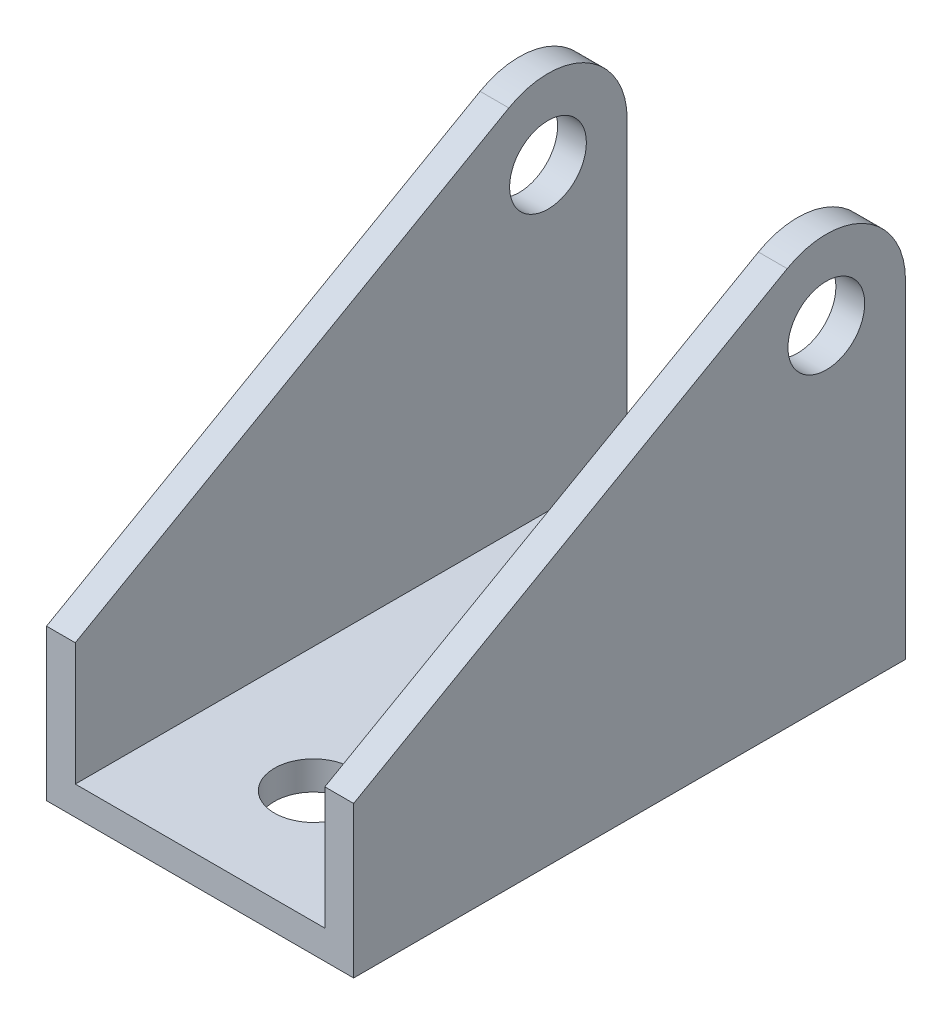
ISO-10303-21;
HEADER;
FILE_DESCRIPTION(('STEP AP214'),'2;1');
FILE_NAME('part.step','',(''),(''),'','','');
FILE_SCHEMA(('AUTOMOTIVE_DESIGN { 1 0 10303 214 1 1 1 1 }'));
ENDSEC;
DATA;
#1=APPLICATION_CONTEXT('core data for automotive mechanical design processes');
#2=APPLICATION_PROTOCOL_DEFINITION('international standard','automotive_design',2000,#1);
#3=PRODUCT_CONTEXT('',#1,'mechanical');
#4=PRODUCT('Part','Part','',(#3));
#5=PRODUCT_RELATED_PRODUCT_CATEGORY('part','',(#4));
#6=PRODUCT_DEFINITION_FORMATION('','',#4);
#7=PRODUCT_DEFINITION_CONTEXT('part definition',#1,'design');
#8=PRODUCT_DEFINITION('design','',#6,#7);
#9=PRODUCT_DEFINITION_SHAPE('','',#8);
#10=(LENGTH_UNIT() NAMED_UNIT(*) SI_UNIT(.MILLI.,.METRE.));
#11=(NAMED_UNIT(*) PLANE_ANGLE_UNIT() SI_UNIT($,.RADIAN.));
#12=(NAMED_UNIT(*) SI_UNIT($,.STERADIAN.) SOLID_ANGLE_UNIT());
#13=UNCERTAINTY_MEASURE_WITH_UNIT(LENGTH_MEASURE(1.E-05),#10,'distance_accuracy_value','');
#14=(GEOMETRIC_REPRESENTATION_CONTEXT(3) GLOBAL_UNCERTAINTY_ASSIGNED_CONTEXT((#13)) GLOBAL_UNIT_ASSIGNED_CONTEXT((#10,
#11,#12)) REPRESENTATION_CONTEXT('',''));
#15=CARTESIAN_POINT('',(0.,0.,0.));
#16=DIRECTION('',(0.,0.,1.));
#17=DIRECTION('',(1.,0.,0.));
#18=AXIS2_PLACEMENT_3D('',#15,#16,#17);
#19=CARTESIAN_POINT('',(-32.512,0.,-58.42));
#20=DIRECTION('',(0.,0.,-1.));
#21=DIRECTION('',(-1.,0.,0.));
#22=AXIS2_PLACEMENT_3D('',#19,#20,#21);
#23=PLANE('',#22);
#24=DIRECTION('',(1.,0.,0.));
#25=VECTOR('',#24,1.);
#26=CARTESIAN_POINT('',(-32.512,0.,-58.42));
#27=LINE('',#26,#25);
#28=CARTESIAN_POINT('',(-11.938,0.,-58.42));
#29=VERTEX_POINT('',#28);
#30=CARTESIAN_POINT('',(0.,0.,-58.42));
#31=VERTEX_POINT('',#30);
#32=EDGE_CURVE('E164',#29,#31,#27,.T.);
#33=ORIENTED_EDGE('',*,*,#32,.F.);
#34=DIRECTION('',(0.,-1.,0.));
#35=VECTOR('',#34,1.);
#36=CARTESIAN_POINT('',(-11.938,43.18,-58.42));
#37=LINE('',#36,#35);
#38=CARTESIAN_POINT('',(-11.938,3.048,-58.42));
#39=VERTEX_POINT('',#38);
#40=EDGE_CURVE('E156',#39,#29,#37,.T.);
#41=ORIENTED_EDGE('',*,*,#40,.F.);
#42=DIRECTION('',(1.,0.,0.));
#43=VECTOR('',#42,1.);
#44=CARTESIAN_POINT('',(-29.464,3.048,-58.42));
#45=LINE('',#44,#43);
#46=CARTESIAN_POINT('',(-3.048,3.048,-58.42));
#47=VERTEX_POINT('',#46);
#48=EDGE_CURVE('E59',#39,#47,#45,.T.);
#49=ORIENTED_EDGE('',*,*,#48,.T.);
#50=DIRECTION('',(0.,1.,0.));
#51=VECTOR('',#50,1.);
#52=CARTESIAN_POINT('',(-3.048,3.048,-58.42));
#53=LINE('',#52,#51);
#54=CARTESIAN_POINT('',(-3.048,34.798,-58.42));
#55=VERTEX_POINT('',#54);
#56=EDGE_CURVE('E203',#47,#55,#53,.T.);
#57=ORIENTED_EDGE('',*,*,#56,.T.);
#58=DIRECTION('',(1.,0.,0.));
#59=VECTOR('',#58,1.);
#60=CARTESIAN_POINT('',(-32.512,34.798,-58.42));
#61=LINE('',#60,#59);
#62=CARTESIAN_POINT('',(0.,34.798,-58.42));
#63=VERTEX_POINT('',#62);
#64=EDGE_CURVE('E163',#55,#63,#61,.T.);
#65=ORIENTED_EDGE('',*,*,#64,.T.);
#66=DIRECTION('',(0.,1.,0.));
#67=VECTOR('',#66,1.);
#68=CARTESIAN_POINT('',(0.,0.,-58.42));
#69=LINE('',#68,#67);
#70=EDGE_CURVE('E248',#31,#63,#69,.T.);
#71=ORIENTED_EDGE('',*,*,#70,.F.);
#72=EDGE_LOOP('',(#33,#41,#49,#57,#65,#71));
#73=FACE_BOUND('',#72,.T.);
#74=ADVANCED_FACE('F35',(#73),#23,.T.);
#75=CARTESIAN_POINT('',(-29.464,3.048,-58.42));
#76=VERTEX_POINT('',#75);
#77=CARTESIAN_POINT('',(-20.574,3.048,-58.42));
#78=VERTEX_POINT('',#77);
#79=EDGE_CURVE('E155',#76,#78,#45,.T.);
#80=ORIENTED_EDGE('',*,*,#79,.T.);
#81=DIRECTION('',(0.,-1.,0.));
#82=VECTOR('',#81,1.);
#83=CARTESIAN_POINT('',(-20.574,43.18,-58.42));
#84=LINE('',#83,#82);
#85=CARTESIAN_POINT('',(-20.574,0.,-58.42));
#86=VERTEX_POINT('',#85);
#87=EDGE_CURVE('E51',#78,#86,#84,.T.);
#88=ORIENTED_EDGE('',*,*,#87,.T.);
#89=CARTESIAN_POINT('',(-32.512,0.,-58.42));
#90=VERTEX_POINT('',#89);
#91=EDGE_CURVE('E151',#90,#86,#27,.T.);
#92=ORIENTED_EDGE('',*,*,#91,.F.);
#93=DIRECTION('',(0.,1.,0.));
#94=VECTOR('',#93,1.);
#95=CARTESIAN_POINT('',(-32.512,0.,-58.42));
#96=LINE('',#95,#94);
#97=CARTESIAN_POINT('',(-32.512,34.798,-58.42));
#98=VERTEX_POINT('',#97);
#99=EDGE_CURVE('E236',#90,#98,#96,.T.);
#100=ORIENTED_EDGE('',*,*,#99,.T.);
#101=CARTESIAN_POINT('',(-29.464,34.798,-58.42));
#102=VERTEX_POINT('',#101);
#103=EDGE_CURVE('E166',#98,#102,#61,.T.);
#104=ORIENTED_EDGE('',*,*,#103,.T.);
#105=DIRECTION('',(0.,-1.,0.));
#106=VECTOR('',#105,1.);
#107=CARTESIAN_POINT('',(-29.464,3.048,-58.42));
#108=LINE('',#107,#106);
#109=EDGE_CURVE('E201',#102,#76,#108,.T.);
#110=ORIENTED_EDGE('',*,*,#109,.T.);
#111=EDGE_LOOP('',(#80,#88,#92,#100,#104,#110));
#112=FACE_BOUND('',#111,.T.);
#113=ADVANCED_FACE('F149',(#112),#23,.T.);
#114=CARTESIAN_POINT('',(-32.512,0.,0.));
#115=DIRECTION('',(0.,-1.,0.));
#116=DIRECTION('',(0.,0.,-1.));
#117=AXIS2_PLACEMENT_3D('',#114,#115,#116);
#118=PLANE('',#117);
#119=CARTESIAN_POINT('',(-16.256,0.,-48.42));
#120=DIRECTION('',(0.,-1.,0.));
#121=DIRECTION('',(0.,0.,-1.));
#122=AXIS2_PLACEMENT_3D('',#119,#120,#121);
#123=CIRCLE('',#122,4.318);
#124=CARTESIAN_POINT('',(-20.574,0.,-48.42));
#125=VERTEX_POINT('',#124);
#126=CARTESIAN_POINT('',(-11.938,0.,-48.42));
#127=VERTEX_POINT('',#126);
#128=EDGE_CURVE('E300',#125,#127,#123,.F.);
#129=ORIENTED_EDGE('',*,*,#128,.T.);
#130=DIRECTION('',(0.,0.,-1.));
#131=VECTOR('',#130,1.);
#132=CARTESIAN_POINT('',(-11.938,0.,0.));
#133=LINE('',#132,#131);
#134=EDGE_CURVE('E144',#127,#29,#133,.T.);
#135=ORIENTED_EDGE('',*,*,#134,.T.);
#136=ORIENTED_EDGE('',*,*,#32,.T.);
#137=DIRECTION('',(0.,0.,-1.));
#138=VECTOR('',#137,1.);
#139=CARTESIAN_POINT('',(0.,0.,0.));
#140=LINE('',#139,#138);
#141=CARTESIAN_POINT('',(0.,0.,0.));
#142=VERTEX_POINT('',#141);
#143=EDGE_CURVE('E245',#142,#31,#140,.T.);
#144=ORIENTED_EDGE('',*,*,#143,.F.);
#145=DIRECTION('',(1.,0.,0.));
#146=VECTOR('',#145,1.);
#147=CARTESIAN_POINT('',(-32.512,0.,0.));
#148=LINE('',#147,#146);
#149=CARTESIAN_POINT('',(-32.512,0.,0.));
#150=VERTEX_POINT('',#149);
#151=EDGE_CURVE('E168',#150,#142,#148,.T.);
#152=ORIENTED_EDGE('',*,*,#151,.F.);
#153=DIRECTION('',(0.,0.,-1.));
#154=VECTOR('',#153,1.);
#155=CARTESIAN_POINT('',(-32.512,0.,0.));
#156=LINE('',#155,#154);
#157=EDGE_CURVE('E162',#150,#90,#156,.T.);
#158=ORIENTED_EDGE('',*,*,#157,.T.);
#159=ORIENTED_EDGE('',*,*,#91,.T.);
#160=DIRECTION('',(0.,0.,1.));
#161=VECTOR('',#160,1.);
#162=CARTESIAN_POINT('',(-20.574,0.,0.));
#163=LINE('',#162,#161);
#164=EDGE_CURVE('E137',#86,#125,#163,.T.);
#165=ORIENTED_EDGE('',*,*,#164,.T.);
#166=EDGE_LOOP('',(#129,#135,#136,#144,#152,#158,#159,#165));
#167=FACE_BOUND('',#166,.T.);
#168=CARTESIAN_POINT('',(-16.256,0.,-12.));
#169=DIRECTION('',(0.,-1.,0.));
#170=DIRECTION('',(0.,0.,-1.));
#171=AXIS2_PLACEMENT_3D('',#168,#169,#170);
#172=CIRCLE('',#171,4.125);
#173=CARTESIAN_POINT('',(-16.256,0.,-16.125));
#174=VERTEX_POINT('',#173);
#175=EDGE_CURVE('E213',#174,#174,#172,.F.);
#176=ORIENTED_EDGE('',*,*,#175,.T.);
#177=EDGE_LOOP('',(#176));
#178=FACE_BOUND('',#177,.T.);
#179=ADVANCED_FACE('F159',(#167,#178),#118,.T.);
#180=CARTESIAN_POINT('',(-29.464,3.048,-58.42));
#181=DIRECTION('',(0.,-1.,0.));
#182=DIRECTION('',(0.,0.,-1.));
#183=AXIS2_PLACEMENT_3D('',#180,#181,#182);
#184=PLANE('',#183);
#185=DIRECTION('',(0.,0.,-1.));
#186=VECTOR('',#185,1.);
#187=CARTESIAN_POINT('',(-11.938,3.048,-58.42));
#188=LINE('',#187,#186);
#189=CARTESIAN_POINT('',(-11.938,3.048,-48.42));
#190=VERTEX_POINT('',#189);
#191=EDGE_CURVE('E11',#190,#39,#188,.T.);
#192=ORIENTED_EDGE('',*,*,#191,.F.);
#193=CARTESIAN_POINT('',(-16.256,3.048,-48.42));
#194=DIRECTION('',(0.,-1.,0.));
#195=DIRECTION('',(0.,0.,-1.));
#196=AXIS2_PLACEMENT_3D('',#193,#194,#195);
#197=CIRCLE('',#196,4.318);
#198=CARTESIAN_POINT('',(-20.574,3.048,-48.42));
#199=VERTEX_POINT('',#198);
#200=EDGE_CURVE('E44',#199,#190,#197,.F.);
#201=ORIENTED_EDGE('',*,*,#200,.F.);
#202=DIRECTION('',(0.,0.,1.));
#203=VECTOR('',#202,1.);
#204=CARTESIAN_POINT('',(-20.574,3.048,-58.42));
#205=LINE('',#204,#203);
#206=EDGE_CURVE('E183',#78,#199,#205,.T.);
#207=ORIENTED_EDGE('',*,*,#206,.F.);
#208=ORIENTED_EDGE('',*,*,#79,.F.);
#209=DIRECTION('',(0.,0.,1.));
#210=VECTOR('',#209,1.);
#211=CARTESIAN_POINT('',(-29.464,3.048,-58.42));
#212=LINE('',#211,#210);
#213=CARTESIAN_POINT('',(-29.464,3.048,0.));
#214=VERTEX_POINT('',#213);
#215=EDGE_CURVE('E209',#76,#214,#212,.T.);
#216=ORIENTED_EDGE('',*,*,#215,.T.);
#217=DIRECTION('',(1.,0.,0.));
#218=VECTOR('',#217,1.);
#219=CARTESIAN_POINT('',(-29.464,3.048,0.));
#220=LINE('',#219,#218);
#221=CARTESIAN_POINT('',(-3.048,3.048,0.));
#222=VERTEX_POINT('',#221);
#223=EDGE_CURVE('E212',#214,#222,#220,.T.);
#224=ORIENTED_EDGE('',*,*,#223,.T.);
#225=DIRECTION('',(0.,0.,1.));
#226=VECTOR('',#225,1.);
#227=CARTESIAN_POINT('',(-3.048,3.048,-58.42));
#228=LINE('',#227,#226);
#229=EDGE_CURVE('E177',#47,#222,#228,.T.);
#230=ORIENTED_EDGE('',*,*,#229,.F.);
#231=ORIENTED_EDGE('',*,*,#48,.F.);
#232=EDGE_LOOP('',(#192,#201,#207,#208,#216,#224,#230,#231));
#233=FACE_BOUND('',#232,.T.);
#234=CARTESIAN_POINT('',(-16.256,3.048,-12.));
#235=DIRECTION('',(0.,-1.,0.));
#236=DIRECTION('',(0.,0.,-1.));
#237=AXIS2_PLACEMENT_3D('',#234,#235,#236);
#238=CIRCLE('',#237,4.125);
#239=CARTESIAN_POINT('',(-16.256,3.048,-16.125));
#240=VERTEX_POINT('',#239);
#241=EDGE_CURVE('E39',#240,#240,#238,.F.);
#242=ORIENTED_EDGE('',*,*,#241,.F.);
#243=EDGE_LOOP('',(#242));
#244=FACE_BOUND('',#243,.T.);
#245=ADVANCED_FACE('F197',(#233,#244),#184,.F.);
#246=CARTESIAN_POINT('',(-32.512,16.002,0.));
#247=DIRECTION('',(0.,0.86940917723071,0.494092787386155));
#248=DIRECTION('',(0.,-0.494092787386155,0.86940917723071));
#249=AXIS2_PLACEMENT_3D('',#246,#247,#248);
#250=PLANE('',#249);
#251=DIRECTION('',(0.,-0.494092787386155,0.86940917723071));
#252=VECTOR('',#251,1.);
#253=CARTESIAN_POINT('',(-29.464,16.002,0.));
#254=LINE('',#253,#252);
#255=CARTESIAN_POINT('',(-29.464,42.0853877235478,-45.8965142561292));
#256=VERTEX_POINT('',#255);
#257=CARTESIAN_POINT('',(-29.464,16.002,0.));
#258=VERTEX_POINT('',#257);
#259=EDGE_CURVE('E222',#256,#258,#254,.T.);
#260=ORIENTED_EDGE('',*,*,#259,.F.);
#261=DIRECTION('',(1.,0.,0.));
#262=VECTOR('',#261,1.);
#263=CARTESIAN_POINT('',(-32.512,42.0853877235478,-45.8965142561292));
#264=LINE('',#263,#262);
#265=CARTESIAN_POINT('',(-32.512,42.0853877235478,-45.8965142561292));
#266=VERTEX_POINT('',#265);
#267=EDGE_CURVE('E258',#266,#256,#264,.T.);
#268=ORIENTED_EDGE('',*,*,#267,.F.);
#269=DIRECTION('',(0.,-0.494092787386155,0.86940917723071));
#270=VECTOR('',#269,1.);
#271=CARTESIAN_POINT('',(-32.512,16.002,0.));
#272=LINE('',#271,#270);
#273=CARTESIAN_POINT('',(-32.512,16.002,0.));
#274=VERTEX_POINT('',#273);
#275=EDGE_CURVE('E172',#266,#274,#272,.T.);
#276=ORIENTED_EDGE('',*,*,#275,.T.);
#277=DIRECTION('',(1.,0.,0.));
#278=VECTOR('',#277,1.);
#279=CARTESIAN_POINT('',(-32.512,16.002,0.));
#280=LINE('',#279,#278);
#281=EDGE_CURVE('E185',#274,#258,#280,.T.);
#282=ORIENTED_EDGE('',*,*,#281,.T.);
#283=EDGE_LOOP('',(#260,#268,#276,#282));
#284=FACE_BOUND('',#283,.T.);
#285=ADVANCED_FACE('F276',(#284),#250,.T.);
#286=CARTESIAN_POINT('',(-32.512,34.798,-50.038));
#287=DIRECTION('',(1.,0.,0.));
#288=DIRECTION('',(0.,0.,-1.));
#289=AXIS2_PLACEMENT_3D('',#286,#287,#288);
#290=CYLINDRICAL_SURFACE('',#289,8.382);
#291=CARTESIAN_POINT('',(-29.464,34.798,-50.038));
#292=DIRECTION('',(-1.,0.,0.));
#293=DIRECTION('',(0.,0.,1.));
#294=AXIS2_PLACEMENT_3D('',#291,#292,#293);
#295=CIRCLE('',#294,8.382);
#296=EDGE_CURVE('E181',#102,#256,#295,.F.);
#297=ORIENTED_EDGE('',*,*,#296,.F.);
#298=ORIENTED_EDGE('',*,*,#103,.F.);
#299=CARTESIAN_POINT('',(-32.512,34.798,-50.038));
#300=DIRECTION('',(1.,0.,0.));
#301=DIRECTION('',(0.,0.,-1.));
#302=AXIS2_PLACEMENT_3D('',#299,#300,#301);
#303=CIRCLE('',#302,8.382);
#304=EDGE_CURVE('E238',#98,#266,#303,.T.);
#305=ORIENTED_EDGE('',*,*,#304,.T.);
#306=ORIENTED_EDGE('',*,*,#267,.T.);
#307=EDGE_LOOP('',(#297,#298,#305,#306));
#308=FACE_BOUND('',#307,.T.);
#309=ADVANCED_FACE('F269',(#308),#290,.T.);
#310=CARTESIAN_POINT('',(-32.512,34.798,-50.038));
#311=DIRECTION('',(1.,0.,0.));
#312=DIRECTION('',(0.,0.,-1.));
#313=AXIS2_PLACEMENT_3D('',#310,#311,#312);
#314=CYLINDRICAL_SURFACE('',#313,4.064);
#315=CARTESIAN_POINT('',(-29.464,34.798,-50.038));
#316=DIRECTION('',(-1.,0.,0.));
#317=DIRECTION('',(0.,0.,1.));
#318=AXIS2_PLACEMENT_3D('',#315,#316,#317);
#319=CIRCLE('',#318,4.064);
#320=CARTESIAN_POINT('',(-29.464,34.798,-45.974));
#321=VERTEX_POINT('',#320);
#322=EDGE_CURVE('E178',#321,#321,#319,.F.);
#323=ORIENTED_EDGE('',*,*,#322,.T.);
#324=EDGE_LOOP('',(#323));
#325=FACE_BOUND('',#324,.T.);
#326=CARTESIAN_POINT('',(-32.512,34.798,-50.038));
#327=DIRECTION('',(1.,0.,0.));
#328=DIRECTION('',(0.,0.,-1.));
#329=AXIS2_PLACEMENT_3D('',#326,#327,#328);
#330=CIRCLE('',#329,4.064);
#331=CARTESIAN_POINT('',(-32.512,34.798,-54.102));
#332=VERTEX_POINT('',#331);
#333=EDGE_CURVE('E225',#332,#332,#330,.T.);
#334=ORIENTED_EDGE('',*,*,#333,.F.);
#335=EDGE_LOOP('',(#334));
#336=FACE_BOUND('',#335,.T.);
#337=ADVANCED_FACE('F336',(#325,#336),#314,.F.);
#338=CARTESIAN_POINT('',(-32.512,0.,0.));
#339=DIRECTION('',(0.,0.,1.));
#340=DIRECTION('',(1.,0.,0.));
#341=AXIS2_PLACEMENT_3D('',#338,#339,#340);
#342=PLANE('',#341);
#343=DIRECTION('',(0.,-1.,0.));
#344=VECTOR('',#343,1.);
#345=CARTESIAN_POINT('',(-29.464,3.048,0.));
#346=LINE('',#345,#344);
#347=EDGE_CURVE('E210',#258,#214,#346,.T.);
#348=ORIENTED_EDGE('',*,*,#347,.F.);
#349=ORIENTED_EDGE('',*,*,#281,.F.);
#350=DIRECTION('',(0.,-1.,0.));
#351=VECTOR('',#350,1.);
#352=CARTESIAN_POINT('',(-32.512,0.,0.));
#353=LINE('',#352,#351);
#354=EDGE_CURVE('E231',#274,#150,#353,.T.);
#355=ORIENTED_EDGE('',*,*,#354,.T.);
#356=ORIENTED_EDGE('',*,*,#151,.T.);
#357=DIRECTION('',(0.,-1.,0.));
#358=VECTOR('',#357,1.);
#359=CARTESIAN_POINT('',(0.,0.,0.));
#360=LINE('',#359,#358);
#361=CARTESIAN_POINT('',(0.,16.002,0.));
#362=VERTEX_POINT('',#361);
#363=EDGE_CURVE('E228',#362,#142,#360,.T.);
#364=ORIENTED_EDGE('',*,*,#363,.F.);
#365=CARTESIAN_POINT('',(-3.048,16.002,0.));
#366=VERTEX_POINT('',#365);
#367=EDGE_CURVE('E257',#366,#362,#280,.T.);
#368=ORIENTED_EDGE('',*,*,#367,.F.);
#369=DIRECTION('',(0.,1.,0.));
#370=VECTOR('',#369,1.);
#371=CARTESIAN_POINT('',(-3.048,3.048,0.));
#372=LINE('',#371,#370);
#373=EDGE_CURVE('E204',#222,#366,#372,.T.);
#374=ORIENTED_EDGE('',*,*,#373,.F.);
#375=ORIENTED_EDGE('',*,*,#223,.F.);
#376=EDGE_LOOP('',(#348,#349,#355,#356,#364,#368,#374,#375));
#377=FACE_BOUND('',#376,.T.);
#378=ADVANCED_FACE('F37',(#377),#342,.T.);
#379=DIRECTION('',(0.,0.494092787386155,-0.86940917723071));
#380=VECTOR('',#379,1.);
#381=CARTESIAN_POINT('',(-3.048,16.002,0.));
#382=LINE('',#381,#380);
#383=CARTESIAN_POINT('',(-3.048,42.0853877235478,-45.8965142561292));
#384=VERTEX_POINT('',#383);
#385=EDGE_CURVE('E182',#366,#384,#382,.T.);
#386=ORIENTED_EDGE('',*,*,#385,.F.);
#387=ORIENTED_EDGE('',*,*,#367,.T.);
#388=DIRECTION('',(0.,-0.494092787386155,0.86940917723071));
#389=VECTOR('',#388,1.);
#390=CARTESIAN_POINT('',(0.,16.002,0.));
#391=LINE('',#390,#389);
#392=CARTESIAN_POINT('',(0.,42.0853877235478,-45.8965142561292));
#393=VERTEX_POINT('',#392);
#394=EDGE_CURVE('E234',#393,#362,#391,.T.);
#395=ORIENTED_EDGE('',*,*,#394,.F.);
#396=EDGE_CURVE('E260',#384,#393,#264,.T.);
#397=ORIENTED_EDGE('',*,*,#396,.F.);
#398=EDGE_LOOP('',(#386,#387,#395,#397));
#399=FACE_BOUND('',#398,.T.);
#400=ADVANCED_FACE('F291',(#399),#250,.T.);
#401=CARTESIAN_POINT('',(-3.048,34.798,-50.038));
#402=DIRECTION('',(1.,0.,0.));
#403=DIRECTION('',(0.,0.,-1.));
#404=AXIS2_PLACEMENT_3D('',#401,#402,#403);
#405=CIRCLE('',#404,8.382);
#406=EDGE_CURVE('E176',#384,#55,#405,.F.);
#407=ORIENTED_EDGE('',*,*,#406,.F.);
#408=ORIENTED_EDGE('',*,*,#396,.T.);
#409=CARTESIAN_POINT('',(0.,34.798,-50.038));
#410=DIRECTION('',(1.,0.,0.));
#411=DIRECTION('',(0.,0.,-1.));
#412=AXIS2_PLACEMENT_3D('',#409,#410,#411);
#413=CIRCLE('',#412,8.382);
#414=EDGE_CURVE('E251',#63,#393,#413,.T.);
#415=ORIENTED_EDGE('',*,*,#414,.F.);
#416=ORIENTED_EDGE('',*,*,#64,.F.);
#417=EDGE_LOOP('',(#407,#408,#415,#416));
#418=FACE_BOUND('',#417,.T.);
#419=ADVANCED_FACE('F297',(#418),#290,.T.);
#420=CARTESIAN_POINT('',(-32.512,34.798,-50.038));
#421=DIRECTION('',(1.,0.,0.));
#422=DIRECTION('',(0.,0.,-1.));
#423=AXIS2_PLACEMENT_3D('',#420,#421,#422);
#424=PLANE('',#423);
#425=ORIENTED_EDGE('',*,*,#333,.T.);
#426=EDGE_LOOP('',(#425));
#427=FACE_BOUND('',#426,.T.);
#428=ORIENTED_EDGE('',*,*,#354,.F.);
#429=ORIENTED_EDGE('',*,*,#275,.F.);
#430=ORIENTED_EDGE('',*,*,#304,.F.);
#431=ORIENTED_EDGE('',*,*,#99,.F.);
#432=ORIENTED_EDGE('',*,*,#157,.F.);
#433=EDGE_LOOP('',(#428,#429,#430,#431,#432));
#434=FACE_BOUND('',#433,.T.);
#435=ADVANCED_FACE('F273',(#427,#434),#424,.F.);
#436=CARTESIAN_POINT('',(0.,34.798,-50.038));
#437=DIRECTION('',(1.,0.,0.));
#438=DIRECTION('',(0.,0.,-1.));
#439=AXIS2_PLACEMENT_3D('',#436,#437,#438);
#440=PLANE('',#439);
#441=CARTESIAN_POINT('',(0.,34.798,-50.038));
#442=DIRECTION('',(1.,0.,0.));
#443=DIRECTION('',(0.,0.,-1.));
#444=AXIS2_PLACEMENT_3D('',#441,#442,#443);
#445=CIRCLE('',#444,4.064);
#446=CARTESIAN_POINT('',(0.,34.798,-54.102));
#447=VERTEX_POINT('',#446);
#448=EDGE_CURVE('E224',#447,#447,#445,.T.);
#449=ORIENTED_EDGE('',*,*,#448,.F.);
#450=EDGE_LOOP('',(#449));
#451=FACE_BOUND('',#450,.T.);
#452=ORIENTED_EDGE('',*,*,#363,.T.);
#453=ORIENTED_EDGE('',*,*,#143,.T.);
#454=ORIENTED_EDGE('',*,*,#70,.T.);
#455=ORIENTED_EDGE('',*,*,#414,.T.);
#456=ORIENTED_EDGE('',*,*,#394,.T.);
#457=EDGE_LOOP('',(#452,#453,#454,#455,#456));
#458=FACE_BOUND('',#457,.T.);
#459=ADVANCED_FACE('F294',(#451,#458),#440,.T.);
#460=CARTESIAN_POINT('',(-3.048,34.798,-50.038));
#461=DIRECTION('',(1.,0.,0.));
#462=DIRECTION('',(0.,0.,-1.));
#463=AXIS2_PLACEMENT_3D('',#460,#461,#462);
#464=CIRCLE('',#463,4.064);
#465=CARTESIAN_POINT('',(-3.048,34.798,-54.102));
#466=VERTEX_POINT('',#465);
#467=EDGE_CURVE('E173',#466,#466,#464,.F.);
#468=ORIENTED_EDGE('',*,*,#467,.T.);
#469=EDGE_LOOP('',(#468));
#470=FACE_BOUND('',#469,.T.);
#471=ORIENTED_EDGE('',*,*,#448,.T.);
#472=EDGE_LOOP('',(#471));
#473=FACE_BOUND('',#472,.T.);
#474=ADVANCED_FACE('F329',(#470,#473),#314,.F.);
#475=CARTESIAN_POINT('',(-29.464,3.048,-58.42));
#476=DIRECTION('',(-1.,0.,0.));
#477=DIRECTION('',(0.,0.,1.));
#478=AXIS2_PLACEMENT_3D('',#475,#476,#477);
#479=PLANE('',#478);
#480=ORIENTED_EDGE('',*,*,#259,.T.);
#481=ORIENTED_EDGE('',*,*,#347,.T.);
#482=ORIENTED_EDGE('',*,*,#215,.F.);
#483=ORIENTED_EDGE('',*,*,#109,.F.);
#484=ORIENTED_EDGE('',*,*,#296,.T.);
#485=EDGE_LOOP('',(#480,#481,#482,#483,#484));
#486=FACE_BOUND('',#485,.T.);
#487=ORIENTED_EDGE('',*,*,#322,.F.);
#488=EDGE_LOOP('',(#487));
#489=FACE_BOUND('',#488,.T.);
#490=ADVANCED_FACE('F279',(#486,#489),#479,.F.);
#491=CARTESIAN_POINT('',(-3.048,3.048,-58.42));
#492=DIRECTION('',(1.,0.,0.));
#493=DIRECTION('',(0.,0.,-1.));
#494=AXIS2_PLACEMENT_3D('',#491,#492,#493);
#495=PLANE('',#494);
#496=ORIENTED_EDGE('',*,*,#385,.T.);
#497=ORIENTED_EDGE('',*,*,#406,.T.);
#498=ORIENTED_EDGE('',*,*,#56,.F.);
#499=ORIENTED_EDGE('',*,*,#229,.T.);
#500=ORIENTED_EDGE('',*,*,#373,.T.);
#501=EDGE_LOOP('',(#496,#497,#498,#499,#500));
#502=FACE_BOUND('',#501,.T.);
#503=ORIENTED_EDGE('',*,*,#467,.F.);
#504=EDGE_LOOP('',(#503));
#505=FACE_BOUND('',#504,.T.);
#506=ADVANCED_FACE('F288',(#502,#505),#495,.F.);
#507=CARTESIAN_POINT('',(-16.256,43.18,-48.42));
#508=DIRECTION('',(0.,-1.,0.));
#509=DIRECTION('',(0.,0.,-1.));
#510=AXIS2_PLACEMENT_3D('',#507,#508,#509);
#511=CYLINDRICAL_SURFACE('',#510,4.318);
#512=DIRECTION('',(0.,-1.,0.));
#513=VECTOR('',#512,1.);
#514=CARTESIAN_POINT('',(-20.574,43.18,-48.42));
#515=LINE('',#514,#513);
#516=EDGE_CURVE('E140',#199,#125,#515,.T.);
#517=ORIENTED_EDGE('',*,*,#516,.F.);
#518=ORIENTED_EDGE('',*,*,#200,.T.);
#519=DIRECTION('',(0.,-1.,0.));
#520=VECTOR('',#519,1.);
#521=CARTESIAN_POINT('',(-11.938,43.18,-48.42));
#522=LINE('',#521,#520);
#523=EDGE_CURVE('E145',#190,#127,#522,.T.);
#524=ORIENTED_EDGE('',*,*,#523,.T.);
#525=ORIENTED_EDGE('',*,*,#128,.F.);
#526=EDGE_LOOP('',(#517,#518,#524,#525));
#527=FACE_BOUND('',#526,.T.);
#528=ADVANCED_FACE('F190',(#527),#511,.F.);
#529=CARTESIAN_POINT('',(-11.938,43.18,-48.42));
#530=DIRECTION('',(-1.,0.,0.));
#531=DIRECTION('',(0.,0.,1.));
#532=AXIS2_PLACEMENT_3D('',#529,#530,#531);
#533=PLANE('',#532);
#534=ORIENTED_EDGE('',*,*,#523,.F.);
#535=ORIENTED_EDGE('',*,*,#191,.T.);
#536=ORIENTED_EDGE('',*,*,#40,.T.);
#537=ORIENTED_EDGE('',*,*,#134,.F.);
#538=EDGE_LOOP('',(#534,#535,#536,#537));
#539=FACE_BOUND('',#538,.T.);
#540=ADVANCED_FACE('F194',(#539),#533,.T.);
#541=CARTESIAN_POINT('',(-20.574,43.18,-48.42));
#542=DIRECTION('',(1.,0.,0.));
#543=DIRECTION('',(0.,0.,-1.));
#544=AXIS2_PLACEMENT_3D('',#541,#542,#543);
#545=PLANE('',#544);
#546=ORIENTED_EDGE('',*,*,#87,.F.);
#547=ORIENTED_EDGE('',*,*,#206,.T.);
#548=ORIENTED_EDGE('',*,*,#516,.T.);
#549=ORIENTED_EDGE('',*,*,#164,.F.);
#550=EDGE_LOOP('',(#546,#547,#548,#549));
#551=FACE_BOUND('',#550,.T.);
#552=ADVANCED_FACE('F138',(#551),#545,.T.);
#553=CARTESIAN_POINT('',(-16.256,43.18,-12.));
#554=DIRECTION('',(0.,-1.,0.));
#555=DIRECTION('',(0.,0.,-1.));
#556=AXIS2_PLACEMENT_3D('',#553,#554,#555);
#557=CYLINDRICAL_SURFACE('',#556,4.125);
#558=ORIENTED_EDGE('',*,*,#175,.F.);
#559=EDGE_LOOP('',(#558));
#560=FACE_BOUND('',#559,.T.);
#561=ORIENTED_EDGE('',*,*,#241,.T.);
#562=EDGE_LOOP('',(#561));
#563=FACE_BOUND('',#562,.T.);
#564=ADVANCED_FACE('F308',(#560,#563),#557,.F.);
#565=CLOSED_SHELL('',(#74,#113,#179,#245,#285,#309,#337,#378,#400,#419,#435,#459,#474,#490,#506,
#528,#540,#552,#564));
#566=MANIFOLD_SOLID_BREP('B2',#565);
#567=ADVANCED_BREP_SHAPE_REPRESENTATION('',(#18,#566),#14);
#568=SHAPE_DEFINITION_REPRESENTATION(#9,#567);
ENDSEC;
END-ISO-10303-21;
